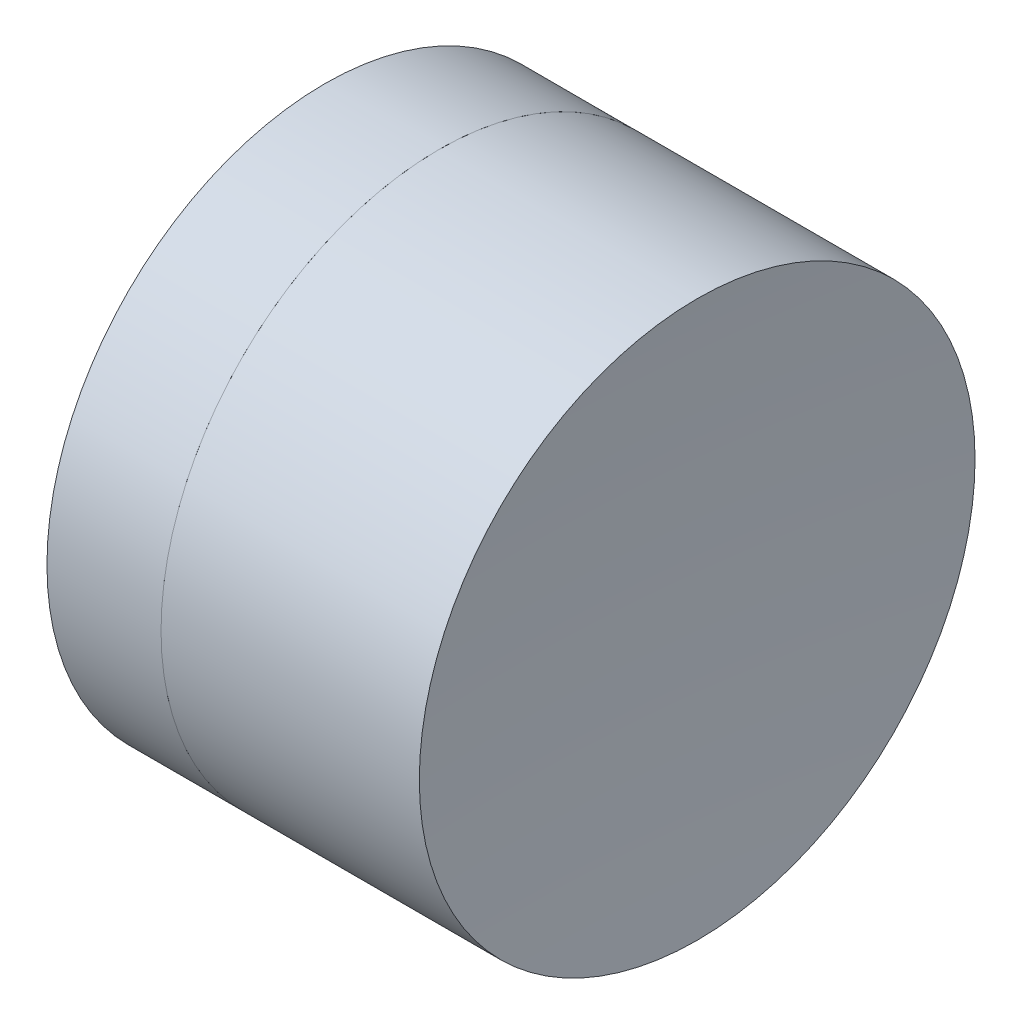
ISO-10303-21;
HEADER;
FILE_DESCRIPTION(('STEP AP214'),'2;1');
FILE_NAME('part.step','',(''),(''),'','','');
FILE_SCHEMA(('AUTOMOTIVE_DESIGN { 1 0 10303 214 1 1 1 1 }'));
ENDSEC;
DATA;
#1=APPLICATION_CONTEXT('core data for automotive mechanical design processes');
#2=APPLICATION_PROTOCOL_DEFINITION('international standard','automotive_design',2000,#1);
#3=PRODUCT_CONTEXT('',#1,'mechanical');
#4=PRODUCT('Part','Part','',(#3));
#5=PRODUCT_RELATED_PRODUCT_CATEGORY('part','',(#4));
#6=PRODUCT_DEFINITION_FORMATION('','',#4);
#7=PRODUCT_DEFINITION_CONTEXT('part definition',#1,'design');
#8=PRODUCT_DEFINITION('design','',#6,#7);
#9=PRODUCT_DEFINITION_SHAPE('','',#8);
#10=(LENGTH_UNIT() NAMED_UNIT(*) SI_UNIT(.MILLI.,.METRE.));
#11=(NAMED_UNIT(*) PLANE_ANGLE_UNIT() SI_UNIT($,.RADIAN.));
#12=(NAMED_UNIT(*) SI_UNIT($,.STERADIAN.) SOLID_ANGLE_UNIT());
#13=UNCERTAINTY_MEASURE_WITH_UNIT(LENGTH_MEASURE(1.E-05),#10,'distance_accuracy_value','');
#14=(GEOMETRIC_REPRESENTATION_CONTEXT(3) GLOBAL_UNCERTAINTY_ASSIGNED_CONTEXT((#13)) GLOBAL_UNIT_ASSIGNED_CONTEXT((#10,
#11,#12)) REPRESENTATION_CONTEXT('',''));
#15=CARTESIAN_POINT('',(0.,0.,0.));
#16=DIRECTION('',(0.,0.,1.));
#17=DIRECTION('',(1.,0.,0.));
#18=AXIS2_PLACEMENT_3D('',#15,#16,#17);
#19=CARTESIAN_POINT('',(-1.51397751524145,0.,0.));
#20=DIRECTION('',(-1.,0.,0.));
#21=DIRECTION('',(0.,0.,-1.));
#22=AXIS2_PLACEMENT_3D('',#19,#20,#21);
#23=SPHERICAL_SURFACE('',#22,4.61);
#24=CARTESIAN_POINT('',(2.35927693031205,0.,0.));
#25=DIRECTION('',(-1.,0.,0.));
#26=DIRECTION('',(0.,0.,1.));
#27=AXIS2_PLACEMENT_3D('',#24,#25,#26);
#28=CIRCLE('',#27,2.5);
#29=CARTESIAN_POINT('',(2.35927693031205,0.,2.5));
#30=VERTEX_POINT('',#29);
#31=EDGE_CURVE('E51',#30,#30,#28,.T.);
#32=ORIENTED_EDGE('',*,*,#31,.T.);
#33=EDGE_LOOP('',(#32));
#34=FACE_BOUND('',#33,.T.);
#35=ADVANCED_FACE('F45',(#34),#23,.F.);
#36=CARTESIAN_POINT('',(40.5460224847585,0.,0.));
#37=DIRECTION('',(-1.,0.,0.));
#38=DIRECTION('',(0.,0.,-1.));
#39=AXIS2_PLACEMENT_3D('',#36,#37,#38);
#40=SPHERICAL_SURFACE('',#39,35.95);
#41=CARTESIAN_POINT('',(4.68305411904737,0.,0.));
#42=DIRECTION('',(-1.,0.,0.));
#43=DIRECTION('',(0.,0.,1.));
#44=AXIS2_PLACEMENT_3D('',#41,#42,#43);
#45=CIRCLE('',#44,2.5);
#46=CARTESIAN_POINT('',(4.68305411904737,0.,2.5));
#47=VERTEX_POINT('',#46);
#48=EDGE_CURVE('E11',#47,#47,#45,.T.);
#49=ORIENTED_EDGE('',*,*,#48,.F.);
#50=EDGE_LOOP('',(#49));
#51=FACE_BOUND('',#50,.T.);
#52=ADVANCED_FACE('F60',(#51),#40,.F.);
#53=CARTESIAN_POINT('',(-0.551919992657797,0.,0.));
#54=DIRECTION('',(-1.,0.,0.));
#55=DIRECTION('',(0.,0.,1.));
#56=AXIS2_PLACEMENT_3D('',#53,#54,#55);
#57=CYLINDRICAL_SURFACE('',#56,2.5);
#58=ORIENTED_EDGE('',*,*,#48,.T.);
#59=EDGE_LOOP('',(#58));
#60=FACE_BOUND('',#59,.T.);
#61=ORIENTED_EDGE('',*,*,#31,.F.);
#62=EDGE_LOOP('',(#61));
#63=FACE_BOUND('',#62,.T.);
#64=ADVANCED_FACE('F58',(#60,#63),#57,.T.);
#65=CLOSED_SHELL('',(#35,#52,#64));
#66=MANIFOLD_SOLID_BREP('B2',#65);
#67=CARTESIAN_POINT('',(5.20602248475855,0.,0.));
#68=DIRECTION('',(-1.,0.,0.));
#69=DIRECTION('',(0.,0.,-1.));
#70=AXIS2_PLACEMENT_3D('',#67,#68,#69);
#71=SPHERICAL_SURFACE('',#70,4.61);
#72=CARTESIAN_POINT('',(1.33276803920504,0.,0.));
#73=DIRECTION('',(-1.,0.,0.));
#74=DIRECTION('',(0.,0.,1.));
#75=AXIS2_PLACEMENT_3D('',#72,#73,#74);
#76=CIRCLE('',#75,2.5);
#77=CARTESIAN_POINT('',(1.33276803920504,0.,2.5));
#78=VERTEX_POINT('',#77);
#79=EDGE_CURVE('E44',#78,#78,#76,.T.);
#80=ORIENTED_EDGE('',*,*,#79,.T.);
#81=EDGE_LOOP('',(#80));
#82=FACE_BOUND('',#81,.T.);
#83=ADVANCED_FACE('F86',(#82),#71,.T.);
#84=CARTESIAN_POINT('',(-0.816062176165804,0.,0.));
#85=DIRECTION('',(-1.,0.,0.));
#86=DIRECTION('',(0.,0.,1.));
#87=AXIS2_PLACEMENT_3D('',#84,#85,#86);
#88=CYLINDRICAL_SURFACE('',#87,2.5);
#89=CARTESIAN_POINT('',(2.35927693031205,0.,0.));
#90=DIRECTION('',(-1.,0.,0.));
#91=DIRECTION('',(0.,0.,1.));
#92=AXIS2_PLACEMENT_3D('',#89,#90,#91);
#93=CIRCLE('',#92,2.5);
#94=CARTESIAN_POINT('',(2.35927693031205,0.,2.5));
#95=VERTEX_POINT('',#94);
#96=EDGE_CURVE('E92',#95,#95,#93,.T.);
#97=ORIENTED_EDGE('',*,*,#96,.T.);
#98=EDGE_LOOP('',(#97));
#99=FACE_BOUND('',#98,.T.);
#100=ORIENTED_EDGE('',*,*,#79,.F.);
#101=EDGE_LOOP('',(#100));
#102=FACE_BOUND('',#101,.T.);
#103=ADVANCED_FACE('F98',(#99,#102),#88,.T.);
#104=CARTESIAN_POINT('',(-1.51397751524145,0.,0.));
#105=DIRECTION('',(-1.,0.,0.));
#106=DIRECTION('',(0.,0.,1.));
#107=AXIS2_PLACEMENT_3D('',#104,#105,#106);
#108=SPHERICAL_SURFACE('',#107,4.61);
#109=ORIENTED_EDGE('',*,*,#96,.F.);
#110=EDGE_LOOP('',(#109));
#111=FACE_BOUND('',#110,.T.);
#112=ADVANCED_FACE('F101',(#111),#108,.T.);
#113=CLOSED_SHELL('',(#83,#103,#112));
#114=MANIFOLD_SOLID_BREP('B6',#113);
#115=ADVANCED_BREP_SHAPE_REPRESENTATION('',(#18,#66,#114),#14);
#116=SHAPE_DEFINITION_REPRESENTATION(#9,#115);
ENDSEC;
END-ISO-10303-21;
